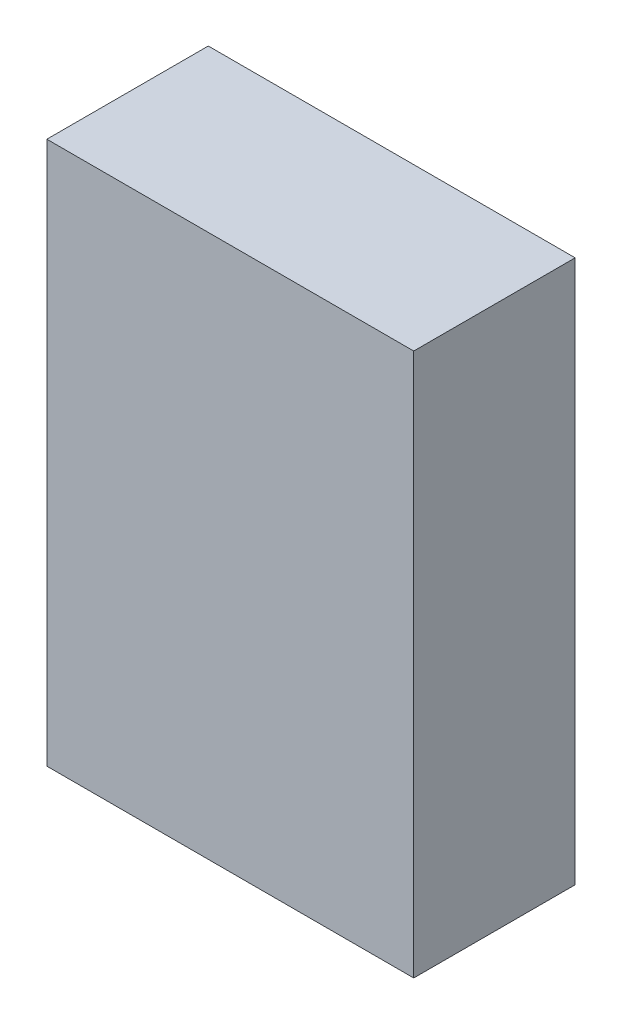
ISO-10303-21;
HEADER;
FILE_DESCRIPTION(('STEP AP214'),'2;1');
FILE_NAME('part.step','',(''),(''),'','','');
FILE_SCHEMA(('AUTOMOTIVE_DESIGN { 1 0 10303 214 1 1 1 1 }'));
ENDSEC;
DATA;
#1=APPLICATION_CONTEXT('core data for automotive mechanical design processes');
#2=APPLICATION_PROTOCOL_DEFINITION('international standard','automotive_design',2000,#1);
#3=PRODUCT_CONTEXT('',#1,'mechanical');
#4=PRODUCT('Part','Part','',(#3));
#5=PRODUCT_RELATED_PRODUCT_CATEGORY('part','',(#4));
#6=PRODUCT_DEFINITION_FORMATION('','',#4);
#7=PRODUCT_DEFINITION_CONTEXT('part definition',#1,'design');
#8=PRODUCT_DEFINITION('design','',#6,#7);
#9=PRODUCT_DEFINITION_SHAPE('','',#8);
#10=(LENGTH_UNIT() NAMED_UNIT(*) SI_UNIT(.MILLI.,.METRE.));
#11=(NAMED_UNIT(*) PLANE_ANGLE_UNIT() SI_UNIT($,.RADIAN.));
#12=(NAMED_UNIT(*) SI_UNIT($,.STERADIAN.) SOLID_ANGLE_UNIT());
#13=UNCERTAINTY_MEASURE_WITH_UNIT(LENGTH_MEASURE(1.E-05),#10,'distance_accuracy_value','');
#14=(GEOMETRIC_REPRESENTATION_CONTEXT(3) GLOBAL_UNCERTAINTY_ASSIGNED_CONTEXT((#13)) GLOBAL_UNIT_ASSIGNED_CONTEXT((#10,
#11,#12)) REPRESENTATION_CONTEXT('',''));
#15=CARTESIAN_POINT('',(0.,0.,0.));
#16=DIRECTION('',(0.,0.,1.));
#17=DIRECTION('',(1.,0.,0.));
#18=AXIS2_PLACEMENT_3D('',#15,#16,#17);
#19=CARTESIAN_POINT('',(-3.75000012,-5.54999906,3.3));
#20=DIRECTION('',(0.,0.,1.));
#21=DIRECTION('',(1.,0.,0.));
#22=AXIS2_PLACEMENT_3D('',#19,#20,#21);
#23=PLANE('',#22);
#24=DIRECTION('',(1.,0.,0.));
#25=VECTOR('',#24,1.);
#26=CARTESIAN_POINT('',(-3.75000012,5.5500016,3.3));
#27=LINE('',#26,#25);
#28=CARTESIAN_POINT('',(-3.75000012,5.5500016,3.3));
#29=VERTEX_POINT('',#28);
#30=CARTESIAN_POINT('',(3.75000012,5.5500016,3.3));
#31=VERTEX_POINT('',#30);
#32=EDGE_CURVE('E53',#29,#31,#27,.T.);
#33=ORIENTED_EDGE('',*,*,#32,.F.);
#34=DIRECTION('',(0.,1.,0.));
#35=VECTOR('',#34,1.);
#36=CARTESIAN_POINT('',(-3.75000012,-5.54999906,3.3));
#37=LINE('',#36,#35);
#38=CARTESIAN_POINT('',(-3.75000012,-5.54999906,3.3));
#39=VERTEX_POINT('',#38);
#40=EDGE_CURVE('E68',#39,#29,#37,.T.);
#41=ORIENTED_EDGE('',*,*,#40,.F.);
#42=DIRECTION('',(1.,0.,0.));
#43=VECTOR('',#42,1.);
#44=CARTESIAN_POINT('',(3.75000012,-5.54999906,3.3));
#45=LINE('',#44,#43);
#46=CARTESIAN_POINT('',(3.75000012,-5.54999906,3.3));
#47=VERTEX_POINT('',#46);
#48=EDGE_CURVE('E20',#47,#39,#45,.F.);
#49=ORIENTED_EDGE('',*,*,#48,.F.);
#50=DIRECTION('',(0.,1.,0.));
#51=VECTOR('',#50,1.);
#52=CARTESIAN_POINT('',(3.75000012,5.5500016,3.3));
#53=LINE('',#52,#51);
#54=EDGE_CURVE('E58',#31,#47,#53,.F.);
#55=ORIENTED_EDGE('',*,*,#54,.F.);
#56=EDGE_LOOP('',(#33,#41,#49,#55));
#57=FACE_BOUND('',#56,.T.);
#58=ADVANCED_FACE('F17',(#57),#23,.T.);
#59=CARTESIAN_POINT('',(3.75000012,-5.54999906,0.));
#60=DIRECTION('',(0.,-1.,0.));
#61=DIRECTION('',(0.,0.,-1.));
#62=AXIS2_PLACEMENT_3D('',#59,#60,#61);
#63=PLANE('',#62);
#64=DIRECTION('',(0.,0.,1.));
#65=VECTOR('',#64,1.);
#66=CARTESIAN_POINT('',(-3.75000012,-5.54999906,0.));
#67=LINE('',#66,#65);
#68=CARTESIAN_POINT('',(-3.75000012,-5.54999906,0.));
#69=VERTEX_POINT('',#68);
#70=EDGE_CURVE('E79',#69,#39,#67,.T.);
#71=ORIENTED_EDGE('',*,*,#70,.F.);
#72=DIRECTION('',(1.,0.,0.));
#73=VECTOR('',#72,1.);
#74=CARTESIAN_POINT('',(-3.75000012,-5.54999906,0.));
#75=LINE('',#74,#73);
#76=CARTESIAN_POINT('',(3.75000012,-5.54999906,0.));
#77=VERTEX_POINT('',#76);
#78=EDGE_CURVE('E74',#69,#77,#75,.T.);
#79=ORIENTED_EDGE('',*,*,#78,.T.);
#80=DIRECTION('',(0.,0.,-1.));
#81=VECTOR('',#80,1.);
#82=CARTESIAN_POINT('',(3.75000012,-5.54999906,0.));
#83=LINE('',#82,#81);
#84=EDGE_CURVE('E63',#47,#77,#83,.T.);
#85=ORIENTED_EDGE('',*,*,#84,.F.);
#86=ORIENTED_EDGE('',*,*,#48,.T.);
#87=EDGE_LOOP('',(#71,#79,#85,#86));
#88=FACE_BOUND('',#87,.T.);
#89=ADVANCED_FACE('F73',(#88),#63,.T.);
#90=CARTESIAN_POINT('',(3.75000012,5.5500016,0.));
#91=DIRECTION('',(1.,0.,0.));
#92=DIRECTION('',(0.,0.,-1.));
#93=AXIS2_PLACEMENT_3D('',#90,#91,#92);
#94=PLANE('',#93);
#95=ORIENTED_EDGE('',*,*,#84,.T.);
#96=DIRECTION('',(0.,1.,0.));
#97=VECTOR('',#96,1.);
#98=CARTESIAN_POINT('',(3.75000012,-5.54999906,0.));
#99=LINE('',#98,#97);
#100=CARTESIAN_POINT('',(3.75000012,5.5500016,0.));
#101=VERTEX_POINT('',#100);
#102=EDGE_CURVE('E84',#77,#101,#99,.T.);
#103=ORIENTED_EDGE('',*,*,#102,.T.);
#104=DIRECTION('',(0.,0.,1.));
#105=VECTOR('',#104,1.);
#106=CARTESIAN_POINT('',(3.75000012,5.5500016,0.));
#107=LINE('',#106,#105);
#108=EDGE_CURVE('E65',#31,#101,#107,.F.);
#109=ORIENTED_EDGE('',*,*,#108,.F.);
#110=ORIENTED_EDGE('',*,*,#54,.T.);
#111=EDGE_LOOP('',(#95,#103,#109,#110));
#112=FACE_BOUND('',#111,.T.);
#113=ADVANCED_FACE('F60',(#112),#94,.T.);
#114=CARTESIAN_POINT('',(-3.75000012,5.5500016,0.));
#115=DIRECTION('',(0.,1.,0.));
#116=DIRECTION('',(0.,0.,1.));
#117=AXIS2_PLACEMENT_3D('',#114,#115,#116);
#118=PLANE('',#117);
#119=ORIENTED_EDGE('',*,*,#108,.T.);
#120=DIRECTION('',(1.,0.,0.));
#121=VECTOR('',#120,1.);
#122=CARTESIAN_POINT('',(-3.75000012,5.5500016,0.));
#123=LINE('',#122,#121);
#124=CARTESIAN_POINT('',(-3.75000012,5.5500016,0.));
#125=VERTEX_POINT('',#124);
#126=EDGE_CURVE('E26',#101,#125,#123,.F.);
#127=ORIENTED_EDGE('',*,*,#126,.T.);
#128=DIRECTION('',(0.,0.,1.));
#129=VECTOR('',#128,1.);
#130=CARTESIAN_POINT('',(-3.75000012,5.5500016,0.));
#131=LINE('',#130,#129);
#132=EDGE_CURVE('E34',#29,#125,#131,.F.);
#133=ORIENTED_EDGE('',*,*,#132,.F.);
#134=ORIENTED_EDGE('',*,*,#32,.T.);
#135=EDGE_LOOP('',(#119,#127,#133,#134));
#136=FACE_BOUND('',#135,.T.);
#137=ADVANCED_FACE('F88',(#136),#118,.T.);
#138=CARTESIAN_POINT('',(-3.75000012,-5.54999906,0.));
#139=DIRECTION('',(-1.,0.,0.));
#140=DIRECTION('',(0.,0.,1.));
#141=AXIS2_PLACEMENT_3D('',#138,#139,#140);
#142=PLANE('',#141);
#143=ORIENTED_EDGE('',*,*,#132,.T.);
#144=DIRECTION('',(0.,1.,0.));
#145=VECTOR('',#144,1.);
#146=CARTESIAN_POINT('',(-3.75000012,-5.54999906,0.));
#147=LINE('',#146,#145);
#148=EDGE_CURVE('E11',#125,#69,#147,.F.);
#149=ORIENTED_EDGE('',*,*,#148,.T.);
#150=ORIENTED_EDGE('',*,*,#70,.T.);
#151=ORIENTED_EDGE('',*,*,#40,.T.);
#152=EDGE_LOOP('',(#143,#149,#150,#151));
#153=FACE_BOUND('',#152,.T.);
#154=ADVANCED_FACE('F91',(#153),#142,.T.);
#155=CARTESIAN_POINT('',(-3.75000012,-5.54999906,0.));
#156=DIRECTION('',(0.,0.,1.));
#157=DIRECTION('',(1.,0.,0.));
#158=AXIS2_PLACEMENT_3D('',#155,#156,#157);
#159=PLANE('',#158);
#160=ORIENTED_EDGE('',*,*,#126,.F.);
#161=ORIENTED_EDGE('',*,*,#102,.F.);
#162=ORIENTED_EDGE('',*,*,#78,.F.);
#163=ORIENTED_EDGE('',*,*,#148,.F.);
#164=EDGE_LOOP('',(#160,#161,#162,#163));
#165=FACE_BOUND('',#164,.T.);
#166=ADVANCED_FACE('F90',(#165),#159,.F.);
#167=CLOSED_SHELL('',(#58,#89,#113,#137,#154,#166));
#168=MANIFOLD_SOLID_BREP('B1',#167);
#169=ADVANCED_BREP_SHAPE_REPRESENTATION('',(#18,#168),#14);
#170=SHAPE_DEFINITION_REPRESENTATION(#9,#169);
ENDSEC;
END-ISO-10303-21;
